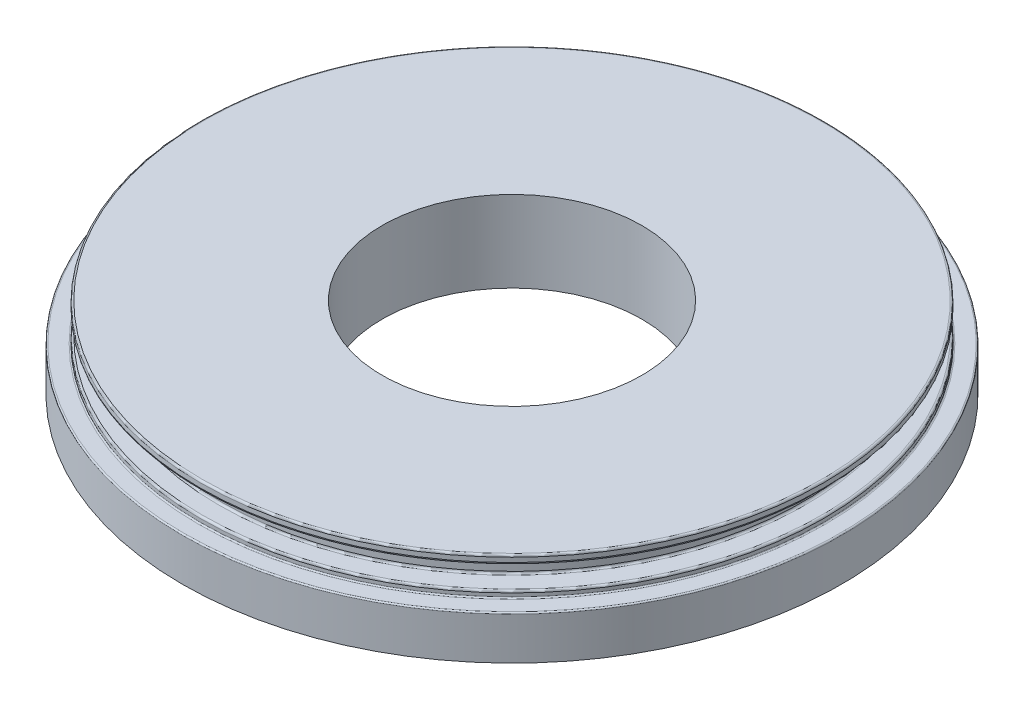
ISO-10303-21;
HEADER;
FILE_DESCRIPTION(('STEP AP214'),'2;1');
FILE_NAME('part.step','',(''),(''),'','','');
FILE_SCHEMA(('AUTOMOTIVE_DESIGN { 1 0 10303 214 1 1 1 1 }'));
ENDSEC;
DATA;
#1=APPLICATION_CONTEXT('core data for automotive mechanical design processes');
#2=APPLICATION_PROTOCOL_DEFINITION('international standard','automotive_design',2000,#1);
#3=PRODUCT_CONTEXT('',#1,'mechanical');
#4=PRODUCT('Part','Part','',(#3));
#5=PRODUCT_RELATED_PRODUCT_CATEGORY('part','',(#4));
#6=PRODUCT_DEFINITION_FORMATION('','',#4);
#7=PRODUCT_DEFINITION_CONTEXT('part definition',#1,'design');
#8=PRODUCT_DEFINITION('design','',#6,#7);
#9=PRODUCT_DEFINITION_SHAPE('','',#8);
#10=(LENGTH_UNIT() NAMED_UNIT(*) SI_UNIT(.MILLI.,.METRE.));
#11=(NAMED_UNIT(*) PLANE_ANGLE_UNIT() SI_UNIT($,.RADIAN.));
#12=(NAMED_UNIT(*) SI_UNIT($,.STERADIAN.) SOLID_ANGLE_UNIT());
#13=UNCERTAINTY_MEASURE_WITH_UNIT(LENGTH_MEASURE(1.E-05),#10,'distance_accuracy_value','');
#14=(GEOMETRIC_REPRESENTATION_CONTEXT(3) GLOBAL_UNCERTAINTY_ASSIGNED_CONTEXT((#13)) GLOBAL_UNIT_ASSIGNED_CONTEXT((#10,
#11,#12)) REPRESENTATION_CONTEXT('',''));
#15=CARTESIAN_POINT('',(0.,0.,0.));
#16=DIRECTION('',(0.,0.,1.));
#17=DIRECTION('',(1.,0.,0.));
#18=AXIS2_PLACEMENT_3D('',#15,#16,#17);
#19=CARTESIAN_POINT('',(0.,0.,0.));
#20=DIRECTION('',(0.,-1.,0.));
#21=DIRECTION('',(0.,0.,-1.));
#22=AXIS2_PLACEMENT_3D('',#19,#20,#21);
#23=CYLINDRICAL_SURFACE('',#22,9.93);
#24=CARTESIAN_POINT('',(0.,6.20428571428572,0.));
#25=DIRECTION('',(0.,-1.,0.));
#26=DIRECTION('',(0.,0.,-1.));
#27=AXIS2_PLACEMENT_3D('',#24,#25,#26);
#28=CIRCLE('',#27,9.93);
#29=CARTESIAN_POINT('',(0.,6.20428571428572,-9.93));
#30=VERTEX_POINT('',#29);
#31=EDGE_CURVE('E111',#30,#30,#28,.T.);
#32=ORIENTED_EDGE('',*,*,#31,.F.);
#33=EDGE_LOOP('',(#32));
#34=FACE_BOUND('',#33,.T.);
#35=CARTESIAN_POINT('',(0.,0.,0.));
#36=DIRECTION('',(0.,-1.,0.));
#37=DIRECTION('',(0.,0.,-1.));
#38=AXIS2_PLACEMENT_3D('',#35,#36,#37);
#39=CIRCLE('',#38,9.93);
#40=CARTESIAN_POINT('',(0.,0.,-9.93));
#41=VERTEX_POINT('',#40);
#42=EDGE_CURVE('E103',#41,#41,#39,.T.);
#43=ORIENTED_EDGE('',*,*,#42,.T.);
#44=EDGE_LOOP('',(#43));
#45=FACE_BOUND('',#44,.T.);
#46=ADVANCED_FACE('F39',(#34,#45),#23,.F.);
#47=CARTESIAN_POINT('',(0.,0.,0.));
#48=DIRECTION('',(0.,-1.,0.));
#49=DIRECTION('',(0.,0.,-1.));
#50=AXIS2_PLACEMENT_3D('',#47,#48,#49);
#51=PLANE('',#50);
#52=CARTESIAN_POINT('',(0.,0.,0.));
#53=DIRECTION('',(0.,-1.,0.));
#54=DIRECTION('',(0.,0.,-1.));
#55=AXIS2_PLACEMENT_3D('',#52,#53,#54);
#56=CIRCLE('',#55,25.2);
#57=CARTESIAN_POINT('',(0.,0.,-25.2));
#58=VERTEX_POINT('',#57);
#59=EDGE_CURVE('E107',#58,#58,#56,.T.);
#60=ORIENTED_EDGE('',*,*,#59,.T.);
#61=EDGE_LOOP('',(#60));
#62=FACE_BOUND('',#61,.T.);
#63=ORIENTED_EDGE('',*,*,#42,.F.);
#64=EDGE_LOOP('',(#63));
#65=FACE_BOUND('',#64,.T.);
#66=ADVANCED_FACE('F120',(#62,#65),#51,.T.);
#67=CARTESIAN_POINT('',(0.,0.,0.));
#68=DIRECTION('',(0.,-1.,0.));
#69=DIRECTION('',(0.,0.,-1.));
#70=AXIS2_PLACEMENT_3D('',#67,#68,#69);
#71=CYLINDRICAL_SURFACE('',#70,25.2);
#72=CARTESIAN_POINT('',(0.,3.24,0.));
#73=DIRECTION('',(0.,1.,0.));
#74=DIRECTION('',(0.,0.,1.));
#75=AXIS2_PLACEMENT_3D('',#72,#73,#74);
#76=CIRCLE('',#75,25.2);
#77=CARTESIAN_POINT('',(0.,3.24,25.2));
#78=VERTEX_POINT('',#77);
#79=EDGE_CURVE('E75',#78,#78,#76,.F.);
#80=ORIENTED_EDGE('',*,*,#79,.T.);
#81=EDGE_LOOP('',(#80));
#82=FACE_BOUND('',#81,.T.);
#83=ORIENTED_EDGE('',*,*,#59,.F.);
#84=EDGE_LOOP('',(#83));
#85=FACE_BOUND('',#84,.T.);
#86=ADVANCED_FACE('F125',(#82,#85),#71,.T.);
#87=CARTESIAN_POINT('',(0.,3.34,0.));
#88=DIRECTION('',(0.,1.,0.));
#89=DIRECTION('',(0.,0.,1.));
#90=AXIS2_PLACEMENT_3D('',#87,#88,#89);
#91=PLANE('',#90);
#92=CARTESIAN_POINT('',(0.,3.34,0.));
#93=DIRECTION('',(0.,1.,0.));
#94=DIRECTION('',(0.,0.,1.));
#95=AXIS2_PLACEMENT_3D('',#92,#93,#94);
#96=CIRCLE('',#95,25.1);
#97=CARTESIAN_POINT('',(0.,3.34,25.1));
#98=VERTEX_POINT('',#97);
#99=EDGE_CURVE('E67',#98,#98,#96,.T.);
#100=ORIENTED_EDGE('',*,*,#99,.T.);
#101=EDGE_LOOP('',(#100));
#102=FACE_BOUND('',#101,.T.);
#103=CARTESIAN_POINT('',(0.,3.34,0.));
#104=DIRECTION('',(0.,1.,0.));
#105=DIRECTION('',(0.,0.,1.));
#106=AXIS2_PLACEMENT_3D('',#103,#104,#105);
#107=CIRCLE('',#106,23.9455560771058);
#108=CARTESIAN_POINT('',(0.,3.34,23.9455560771058));
#109=VERTEX_POINT('',#108);
#110=EDGE_CURVE('E71',#109,#109,#107,.F.);
#111=ORIENTED_EDGE('',*,*,#110,.T.);
#112=EDGE_LOOP('',(#111));
#113=FACE_BOUND('',#112,.T.);
#114=ADVANCED_FACE('F131',(#102,#113),#91,.T.);
#115=CARTESIAN_POINT('',(0.,0.,0.));
#116=DIRECTION('',(0.,-1.,0.));
#117=DIRECTION('',(0.,0.,-1.));
#118=AXIS2_PLACEMENT_3D('',#115,#116,#117);
#119=CYLINDRICAL_SURFACE('',#118,23.8455560771058);
#120=CARTESIAN_POINT('',(0.,3.44,0.));
#121=DIRECTION('',(0.,1.,0.));
#122=DIRECTION('',(0.,0.,1.));
#123=AXIS2_PLACEMENT_3D('',#120,#121,#122);
#124=CIRCLE('',#123,23.8455560771058);
#125=CARTESIAN_POINT('',(0.,3.44,23.8455560771058));
#126=VERTEX_POINT('',#125);
#127=EDGE_CURVE('E63',#126,#126,#124,.T.);
#128=ORIENTED_EDGE('',*,*,#127,.T.);
#129=EDGE_LOOP('',(#128));
#130=FACE_BOUND('',#129,.T.);
#131=CARTESIAN_POINT('',(0.,3.69,0.));
#132=DIRECTION('',(0.,1.,0.));
#133=DIRECTION('',(0.,0.,1.));
#134=AXIS2_PLACEMENT_3D('',#131,#132,#133);
#135=CIRCLE('',#134,23.8455560771058);
#136=CARTESIAN_POINT('',(0.,3.69,23.8455560771058));
#137=VERTEX_POINT('',#136);
#138=EDGE_CURVE('E91',#137,#137,#135,.F.);
#139=ORIENTED_EDGE('',*,*,#138,.T.);
#140=EDGE_LOOP('',(#139));
#141=FACE_BOUND('',#140,.T.);
#142=ADVANCED_FACE('F170',(#130,#141),#119,.T.);
#143=CARTESIAN_POINT('',(0.,3.84,0.));
#144=DIRECTION('',(0.,1.,0.));
#145=DIRECTION('',(0.,0.,1.));
#146=AXIS2_PLACEMENT_3D('',#143,#144,#145);
#147=PLANE('',#146);
#148=CARTESIAN_POINT('',(0.,3.84,0.));
#149=DIRECTION('',(0.,1.,0.));
#150=DIRECTION('',(0.,0.,1.));
#151=AXIS2_PLACEMENT_3D('',#148,#149,#150);
#152=CIRCLE('',#151,22.4);
#153=CARTESIAN_POINT('',(0.,3.84,22.4));
#154=VERTEX_POINT('',#153);
#155=EDGE_CURVE('E57',#154,#154,#152,.F.);
#156=ORIENTED_EDGE('',*,*,#155,.T.);
#157=EDGE_LOOP('',(#156));
#158=FACE_BOUND('',#157,.T.);
#159=CARTESIAN_POINT('',(0.,3.84,0.));
#160=DIRECTION('',(0.,1.,0.));
#161=DIRECTION('',(0.,0.,1.));
#162=AXIS2_PLACEMENT_3D('',#159,#160,#161);
#163=CIRCLE('',#162,23.6955560771058);
#164=CARTESIAN_POINT('',(0.,3.84,23.6955560771058));
#165=VERTEX_POINT('',#164);
#166=EDGE_CURVE('E87',#165,#165,#163,.T.);
#167=ORIENTED_EDGE('',*,*,#166,.T.);
#168=EDGE_LOOP('',(#167));
#169=FACE_BOUND('',#168,.T.);
#170=ADVANCED_FACE('F166',(#158,#169),#147,.T.);
#171=CARTESIAN_POINT('',(0.,0.,0.));
#172=DIRECTION('',(0.,-1.,0.));
#173=DIRECTION('',(0.,0.,-1.));
#174=AXIS2_PLACEMENT_3D('',#171,#172,#173);
#175=CYLINDRICAL_SURFACE('',#174,22.25);
#176=CARTESIAN_POINT('',(0.,5.40428571428572,0.));
#177=DIRECTION('',(0.,-1.,0.));
#178=DIRECTION('',(0.,0.,-1.));
#179=AXIS2_PLACEMENT_3D('',#176,#177,#178);
#180=CIRCLE('',#179,22.25);
#181=CARTESIAN_POINT('',(0.,5.40428571428572,-22.25));
#182=VERTEX_POINT('',#181);
#183=EDGE_CURVE('E47',#182,#182,#180,.T.);
#184=ORIENTED_EDGE('',*,*,#183,.T.);
#185=EDGE_LOOP('',(#184));
#186=FACE_BOUND('',#185,.T.);
#187=CARTESIAN_POINT('',(0.,3.99,0.));
#188=DIRECTION('',(0.,1.,0.));
#189=DIRECTION('',(0.,0.,1.));
#190=AXIS2_PLACEMENT_3D('',#187,#188,#189);
#191=CIRCLE('',#190,22.25);
#192=CARTESIAN_POINT('',(0.,3.99,22.25));
#193=VERTEX_POINT('',#192);
#194=EDGE_CURVE('E52',#193,#193,#191,.T.);
#195=ORIENTED_EDGE('',*,*,#194,.T.);
#196=EDGE_LOOP('',(#195));
#197=FACE_BOUND('',#196,.T.);
#198=ADVANCED_FACE('F169',(#186,#197),#175,.T.);
#199=CARTESIAN_POINT('',(0.,5.55428571428572,0.));
#200=DIRECTION('',(0.,-1.,0.));
#201=DIRECTION('',(0.,0.,-1.));
#202=AXIS2_PLACEMENT_3D('',#199,#200,#201);
#203=PLANE('',#202);
#204=CARTESIAN_POINT('',(0.,5.55428571428572,0.));
#205=DIRECTION('',(0.,-1.,0.));
#206=DIRECTION('',(0.,0.,-1.));
#207=AXIS2_PLACEMENT_3D('',#204,#205,#206);
#208=CIRCLE('',#207,22.4);
#209=CARTESIAN_POINT('',(0.,5.55428571428572,-22.4));
#210=VERTEX_POINT('',#209);
#211=EDGE_CURVE('E10',#210,#210,#208,.F.);
#212=ORIENTED_EDGE('',*,*,#211,.T.);
#213=EDGE_LOOP('',(#212));
#214=FACE_BOUND('',#213,.T.);
#215=CARTESIAN_POINT('',(0.,5.55428571428572,0.));
#216=DIRECTION('',(0.,-1.,0.));
#217=DIRECTION('',(0.,0.,-1.));
#218=AXIS2_PLACEMENT_3D('',#215,#216,#217);
#219=CIRCLE('',#218,23.6955560771058);
#220=CARTESIAN_POINT('',(0.,5.55428571428572,-23.6955560771058));
#221=VERTEX_POINT('',#220);
#222=EDGE_CURVE('E83',#221,#221,#219,.T.);
#223=ORIENTED_EDGE('',*,*,#222,.T.);
#224=EDGE_LOOP('',(#223));
#225=FACE_BOUND('',#224,.T.);
#226=ADVANCED_FACE('F186',(#214,#225),#203,.T.);
#227=CARTESIAN_POINT('',(0.,0.,0.));
#228=DIRECTION('',(0.,-1.,0.));
#229=DIRECTION('',(0.,0.,-1.));
#230=AXIS2_PLACEMENT_3D('',#227,#228,#229);
#231=CYLINDRICAL_SURFACE('',#230,23.8455560771058);
#232=CARTESIAN_POINT('',(0.,5.70428571428572,0.));
#233=DIRECTION('',(0.,-1.,0.));
#234=DIRECTION('',(0.,0.,-1.));
#235=AXIS2_PLACEMENT_3D('',#232,#233,#234);
#236=CIRCLE('',#235,23.8455560771058);
#237=CARTESIAN_POINT('',(0.,5.70428571428572,-23.8455560771058));
#238=VERTEX_POINT('',#237);
#239=EDGE_CURVE('E79',#238,#238,#236,.F.);
#240=ORIENTED_EDGE('',*,*,#239,.T.);
#241=EDGE_LOOP('',(#240));
#242=FACE_BOUND('',#241,.T.);
#243=CARTESIAN_POINT('',(0.,6.05428571428572,0.));
#244=DIRECTION('',(0.,1.,0.));
#245=DIRECTION('',(0.,0.,1.));
#246=AXIS2_PLACEMENT_3D('',#243,#244,#245);
#247=CIRCLE('',#246,23.8455560771058);
#248=CARTESIAN_POINT('',(0.,6.05428571428572,23.8455560771058));
#249=VERTEX_POINT('',#248);
#250=EDGE_CURVE('E99',#249,#249,#247,.F.);
#251=ORIENTED_EDGE('',*,*,#250,.T.);
#252=EDGE_LOOP('',(#251));
#253=FACE_BOUND('',#252,.T.);
#254=ADVANCED_FACE('F189',(#242,#253),#231,.T.);
#255=CARTESIAN_POINT('',(0.,6.20428571428572,0.));
#256=DIRECTION('',(0.,1.,0.));
#257=DIRECTION('',(0.,0.,1.));
#258=AXIS2_PLACEMENT_3D('',#255,#256,#257);
#259=PLANE('',#258);
#260=CARTESIAN_POINT('',(0.,6.20428571428572,0.));
#261=DIRECTION('',(0.,1.,0.));
#262=DIRECTION('',(0.,0.,1.));
#263=AXIS2_PLACEMENT_3D('',#260,#261,#262);
#264=CIRCLE('',#263,23.6955560771058);
#265=CARTESIAN_POINT('',(0.,6.20428571428572,23.6955560771058));
#266=VERTEX_POINT('',#265);
#267=EDGE_CURVE('E95',#266,#266,#264,.T.);
#268=ORIENTED_EDGE('',*,*,#267,.T.);
#269=EDGE_LOOP('',(#268));
#270=FACE_BOUND('',#269,.T.);
#271=ORIENTED_EDGE('',*,*,#31,.T.);
#272=EDGE_LOOP('',(#271));
#273=FACE_BOUND('',#272,.T.);
#274=ADVANCED_FACE('F116',(#270,#273),#259,.T.);
#275=CARTESIAN_POINT('',(0.,6.05428571428572,0.));
#276=DIRECTION('',(0.,1.,0.));
#277=DIRECTION('',(0.,0.,1.));
#278=AXIS2_PLACEMENT_3D('',#275,#276,#277);
#279=TOROIDAL_SURFACE('',#278,23.6955560771058,0.15);
#280=ORIENTED_EDGE('',*,*,#267,.F.);
#281=EDGE_LOOP('',(#280));
#282=FACE_BOUND('',#281,.T.);
#283=ORIENTED_EDGE('',*,*,#250,.F.);
#284=EDGE_LOOP('',(#283));
#285=FACE_BOUND('',#284,.T.);
#286=ADVANCED_FACE('F136',(#282,#285),#279,.T.);
#287=CARTESIAN_POINT('',(0.,3.69,0.));
#288=DIRECTION('',(0.,1.,0.));
#289=DIRECTION('',(0.,0.,1.));
#290=AXIS2_PLACEMENT_3D('',#287,#288,#289);
#291=TOROIDAL_SURFACE('',#290,23.6955560771058,0.15);
#292=ORIENTED_EDGE('',*,*,#166,.F.);
#293=EDGE_LOOP('',(#292));
#294=FACE_BOUND('',#293,.T.);
#295=ORIENTED_EDGE('',*,*,#138,.F.);
#296=EDGE_LOOP('',(#295));
#297=FACE_BOUND('',#296,.T.);
#298=ADVANCED_FACE('F139',(#294,#297),#291,.T.);
#299=CARTESIAN_POINT('',(0.,5.70428571428572,0.));
#300=DIRECTION('',(0.,-1.,0.));
#301=DIRECTION('',(0.,0.,-1.));
#302=AXIS2_PLACEMENT_3D('',#299,#300,#301);
#303=TOROIDAL_SURFACE('',#302,23.6955560771058,0.15);
#304=ORIENTED_EDGE('',*,*,#239,.F.);
#305=EDGE_LOOP('',(#304));
#306=FACE_BOUND('',#305,.T.);
#307=ORIENTED_EDGE('',*,*,#222,.F.);
#308=EDGE_LOOP('',(#307));
#309=FACE_BOUND('',#308,.T.);
#310=ADVANCED_FACE('F143',(#306,#309),#303,.T.);
#311=CARTESIAN_POINT('',(0.,3.24,0.));
#312=DIRECTION('',(0.,1.,0.));
#313=DIRECTION('',(0.,0.,1.));
#314=AXIS2_PLACEMENT_3D('',#311,#312,#313);
#315=TOROIDAL_SURFACE('',#314,25.1,0.1);
#316=ORIENTED_EDGE('',*,*,#99,.F.);
#317=EDGE_LOOP('',(#316));
#318=FACE_BOUND('',#317,.T.);
#319=ORIENTED_EDGE('',*,*,#79,.F.);
#320=EDGE_LOOP('',(#319));
#321=FACE_BOUND('',#320,.T.);
#322=ADVANCED_FACE('F147',(#318,#321),#315,.T.);
#323=CARTESIAN_POINT('',(0.,3.44,0.));
#324=DIRECTION('',(0.,1.,0.));
#325=DIRECTION('',(0.,0.,1.));
#326=AXIS2_PLACEMENT_3D('',#323,#324,#325);
#327=TOROIDAL_SURFACE('',#326,23.9455560771058,0.1);
#328=ORIENTED_EDGE('',*,*,#127,.F.);
#329=EDGE_LOOP('',(#328));
#330=FACE_BOUND('',#329,.T.);
#331=ORIENTED_EDGE('',*,*,#110,.F.);
#332=EDGE_LOOP('',(#331));
#333=FACE_BOUND('',#332,.T.);
#334=ADVANCED_FACE('F151',(#330,#333),#327,.F.);
#335=CARTESIAN_POINT('',(0.,3.99,0.));
#336=DIRECTION('',(0.,1.,0.));
#337=DIRECTION('',(0.,0.,1.));
#338=AXIS2_PLACEMENT_3D('',#335,#336,#337);
#339=TOROIDAL_SURFACE('',#338,22.4,0.15);
#340=ORIENTED_EDGE('',*,*,#194,.F.);
#341=EDGE_LOOP('',(#340));
#342=FACE_BOUND('',#341,.T.);
#343=ORIENTED_EDGE('',*,*,#155,.F.);
#344=EDGE_LOOP('',(#343));
#345=FACE_BOUND('',#344,.T.);
#346=ADVANCED_FACE('F154',(#342,#345),#339,.F.);
#347=CARTESIAN_POINT('',(0.,5.40428571428572,0.));
#348=DIRECTION('',(0.,-1.,0.));
#349=DIRECTION('',(0.,0.,-1.));
#350=AXIS2_PLACEMENT_3D('',#347,#348,#349);
#351=TOROIDAL_SURFACE('',#350,22.4,0.15);
#352=ORIENTED_EDGE('',*,*,#211,.F.);
#353=EDGE_LOOP('',(#352));
#354=FACE_BOUND('',#353,.T.);
#355=ORIENTED_EDGE('',*,*,#183,.F.);
#356=EDGE_LOOP('',(#355));
#357=FACE_BOUND('',#356,.T.);
#358=ADVANCED_FACE('F41',(#354,#357),#351,.F.);
#359=CLOSED_SHELL('',(#46,#66,#86,#114,#142,#170,#198,#226,#254,#274,#286,#298,#310,#322,#334,
#346,#358));
#360=MANIFOLD_SOLID_BREP('B2',#359);
#361=ADVANCED_BREP_SHAPE_REPRESENTATION('',(#18,#360),#14);
#362=SHAPE_DEFINITION_REPRESENTATION(#9,#361);
ENDSEC;
END-ISO-10303-21;
